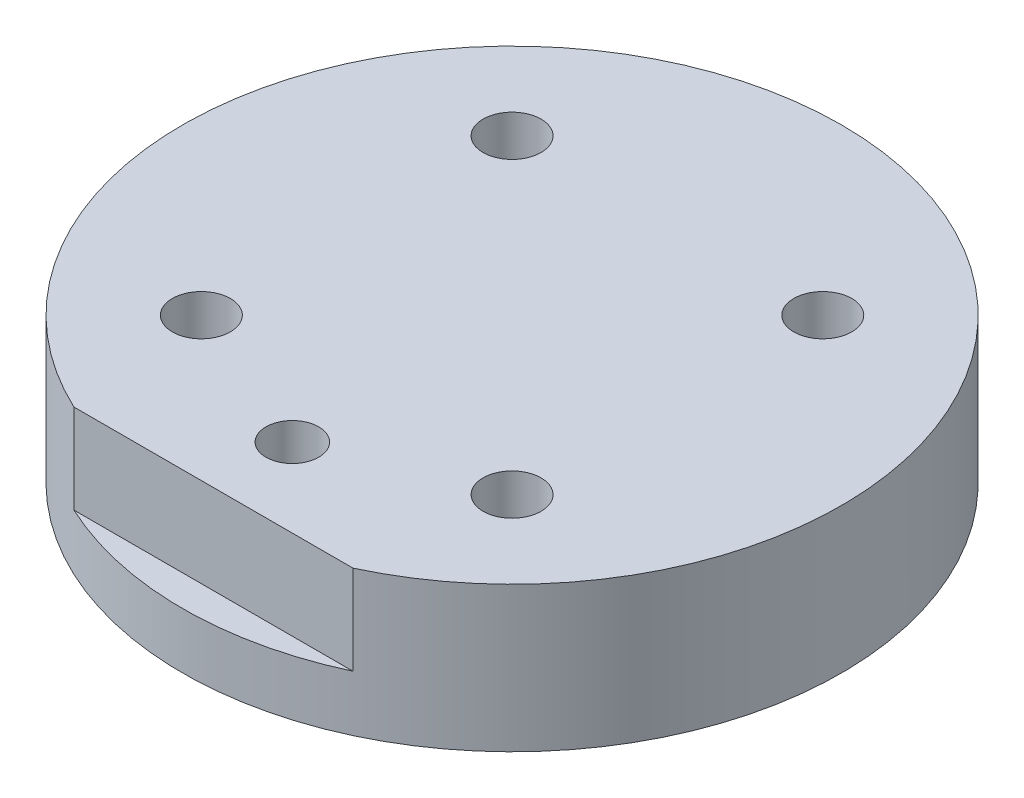
ISO-10303-21;
HEADER;
FILE_DESCRIPTION(('STEP AP214'),'2;1');
FILE_NAME('part.step','',(''),(''),'','','');
FILE_SCHEMA(('AUTOMOTIVE_DESIGN { 1 0 10303 214 1 1 1 1 }'));
ENDSEC;
DATA;
#1=APPLICATION_CONTEXT('core data for automotive mechanical design processes');
#2=APPLICATION_PROTOCOL_DEFINITION('international standard','automotive_design',2000,#1);
#3=PRODUCT_CONTEXT('',#1,'mechanical');
#4=PRODUCT('Part','Part','',(#3));
#5=PRODUCT_RELATED_PRODUCT_CATEGORY('part','',(#4));
#6=PRODUCT_DEFINITION_FORMATION('','',#4);
#7=PRODUCT_DEFINITION_CONTEXT('part definition',#1,'design');
#8=PRODUCT_DEFINITION('design','',#6,#7);
#9=PRODUCT_DEFINITION_SHAPE('','',#8);
#10=(LENGTH_UNIT() NAMED_UNIT(*) SI_UNIT(.MILLI.,.METRE.));
#11=(NAMED_UNIT(*) PLANE_ANGLE_UNIT() SI_UNIT($,.RADIAN.));
#12=(NAMED_UNIT(*) SI_UNIT($,.STERADIAN.) SOLID_ANGLE_UNIT());
#13=UNCERTAINTY_MEASURE_WITH_UNIT(LENGTH_MEASURE(1.E-05),#10,'distance_accuracy_value','');
#14=(GEOMETRIC_REPRESENTATION_CONTEXT(3) GLOBAL_UNCERTAINTY_ASSIGNED_CONTEXT((#13)) GLOBAL_UNIT_ASSIGNED_CONTEXT((#10,
#11,#12)) REPRESENTATION_CONTEXT('',''));
#15=CARTESIAN_POINT('',(0.,0.,0.));
#16=DIRECTION('',(0.,0.,1.));
#17=DIRECTION('',(1.,0.,0.));
#18=AXIS2_PLACEMENT_3D('',#15,#16,#17);
#19=CARTESIAN_POINT('',(0.,0.,0.));
#20=DIRECTION('',(0.,1.,0.));
#21=DIRECTION('',(0.,0.,1.));
#22=AXIS2_PLACEMENT_3D('',#19,#20,#21);
#23=PLANE('',#22);
#24=CARTESIAN_POINT('',(17.6776695296638,0.,17.6776695296637));
#25=DIRECTION('',(0.,-1.,0.));
#26=DIRECTION('',(0.,0.,-1.));
#27=AXIS2_PLACEMENT_3D('',#24,#25,#26);
#28=CIRCLE('',#27,6.3);
#29=CARTESIAN_POINT('',(17.6776695296638,0.,11.3776695296637));
#30=VERTEX_POINT('',#29);
#31=EDGE_CURVE('E215',#30,#30,#28,.T.);
#32=ORIENTED_EDGE('',*,*,#31,.F.);
#33=EDGE_LOOP('',(#32));
#34=FACE_BOUND('',#33,.T.);
#35=CARTESIAN_POINT('',(-17.6776695296637,0.,17.6776695296637));
#36=DIRECTION('',(0.,-1.,0.));
#37=DIRECTION('',(0.,0.,-1.));
#38=AXIS2_PLACEMENT_3D('',#35,#36,#37);
#39=CIRCLE('',#38,6.3);
#40=CARTESIAN_POINT('',(-17.6776695296637,0.,11.3776695296637));
#41=VERTEX_POINT('',#40);
#42=EDGE_CURVE('E206',#41,#41,#39,.T.);
#43=ORIENTED_EDGE('',*,*,#42,.F.);
#44=EDGE_LOOP('',(#43));
#45=FACE_BOUND('',#44,.T.);
#46=CARTESIAN_POINT('',(-17.6776695296638,0.,-17.6776695296637));
#47=DIRECTION('',(0.,-1.,0.));
#48=DIRECTION('',(0.,0.,-1.));
#49=AXIS2_PLACEMENT_3D('',#46,#47,#48);
#50=CIRCLE('',#49,6.3);
#51=CARTESIAN_POINT('',(-17.6776695296638,0.,-23.9776695296637));
#52=VERTEX_POINT('',#51);
#53=EDGE_CURVE('E197',#52,#52,#50,.T.);
#54=ORIENTED_EDGE('',*,*,#53,.F.);
#55=EDGE_LOOP('',(#54));
#56=FACE_BOUND('',#55,.T.);
#57=CARTESIAN_POINT('',(17.6776695296636,0.,-17.6776695296637));
#58=DIRECTION('',(0.,-1.,0.));
#59=DIRECTION('',(0.,0.,-1.));
#60=AXIS2_PLACEMENT_3D('',#57,#58,#59);
#61=CIRCLE('',#60,6.3);
#62=CARTESIAN_POINT('',(17.6776695296636,0.,-23.9776695296637));
#63=VERTEX_POINT('',#62);
#64=EDGE_CURVE('E188',#63,#63,#61,.T.);
#65=ORIENTED_EDGE('',*,*,#64,.F.);
#66=EDGE_LOOP('',(#65));
#67=FACE_BOUND('',#66,.T.);
#68=CARTESIAN_POINT('',(-27.305,0.,-16.1925));
#69=DIRECTION('',(0.,-1.,0.));
#70=DIRECTION('',(0.,0.,-1.));
#71=AXIS2_PLACEMENT_3D('',#68,#69,#70);
#72=CIRCLE('',#71,2.09999999999999);
#73=CARTESIAN_POINT('',(-27.305,0.,-18.2925));
#74=VERTEX_POINT('',#73);
#75=EDGE_CURVE('E182',#74,#74,#72,.T.);
#76=ORIENTED_EDGE('',*,*,#75,.F.);
#77=EDGE_LOOP('',(#76));
#78=FACE_BOUND('',#77,.T.);
#79=CARTESIAN_POINT('',(-27.305,0.,16.1925));
#80=DIRECTION('',(0.,-1.,0.));
#81=DIRECTION('',(0.,0.,-1.));
#82=AXIS2_PLACEMENT_3D('',#79,#80,#81);
#83=CIRCLE('',#82,2.09999999999999);
#84=CARTESIAN_POINT('',(-27.305,0.,14.0925));
#85=VERTEX_POINT('',#84);
#86=EDGE_CURVE('E176',#85,#85,#83,.T.);
#87=ORIENTED_EDGE('',*,*,#86,.F.);
#88=EDGE_LOOP('',(#87));
#89=FACE_BOUND('',#88,.T.);
#90=CARTESIAN_POINT('',(27.305,0.,16.1925));
#91=DIRECTION('',(0.,-1.,0.));
#92=DIRECTION('',(0.,0.,-1.));
#93=AXIS2_PLACEMENT_3D('',#90,#91,#92);
#94=CIRCLE('',#93,2.09999999999999);
#95=CARTESIAN_POINT('',(27.305,0.,14.0925));
#96=VERTEX_POINT('',#95);
#97=EDGE_CURVE('E170',#96,#96,#94,.T.);
#98=ORIENTED_EDGE('',*,*,#97,.F.);
#99=EDGE_LOOP('',(#98));
#100=FACE_BOUND('',#99,.T.);
#101=CARTESIAN_POINT('',(27.305,0.,-16.1925));
#102=DIRECTION('',(0.,-1.,0.));
#103=DIRECTION('',(0.,0.,-1.));
#104=AXIS2_PLACEMENT_3D('',#101,#102,#103);
#105=CIRCLE('',#104,2.09999999999999);
#106=CARTESIAN_POINT('',(27.305,0.,-18.2925));
#107=VERTEX_POINT('',#106);
#108=EDGE_CURVE('E162',#107,#107,#105,.T.);
#109=ORIENTED_EDGE('',*,*,#108,.F.);
#110=EDGE_LOOP('',(#109));
#111=FACE_BOUND('',#110,.T.);
#112=CARTESIAN_POINT('',(-30.5150000000001,0.,0.));
#113=DIRECTION('',(0.,1.,0.));
#114=DIRECTION('',(0.,0.,1.));
#115=AXIS2_PLACEMENT_3D('',#112,#113,#114);
#116=CIRCLE('',#115,1.9685);
#117=CARTESIAN_POINT('',(-30.5150000000001,0.,1.9685));
#118=VERTEX_POINT('',#117);
#119=EDGE_CURVE('E153',#118,#118,#116,.T.);
#120=ORIENTED_EDGE('',*,*,#119,.T.);
#121=EDGE_LOOP('',(#120));
#122=FACE_BOUND('',#121,.T.);
#123=DIRECTION('',(1.,0.,0.));
#124=VECTOR('',#123,1.);
#125=CARTESIAN_POINT('',(-18.9072000000001,0.,-3.175));
#126=LINE('',#125,#124);
#127=CARTESIAN_POINT('',(-18.9072000000001,0.,-3.175));
#128=VERTEX_POINT('',#127);
#129=CARTESIAN_POINT('',(-6.2072000000001,0.,-3.175));
#130=VERTEX_POINT('',#129);
#131=EDGE_CURVE('E134',#128,#130,#126,.T.);
#132=ORIENTED_EDGE('',*,*,#131,.F.);
#133=DIRECTION('',(0.,0.,1.));
#134=VECTOR('',#133,1.);
#135=CARTESIAN_POINT('',(-18.9072000000001,0.,-3.175));
#136=LINE('',#135,#134);
#137=CARTESIAN_POINT('',(-18.9072000000001,0.,3.175));
#138=VERTEX_POINT('',#137);
#139=EDGE_CURVE('E142',#128,#138,#136,.T.);
#140=ORIENTED_EDGE('',*,*,#139,.T.);
#141=DIRECTION('',(1.,0.,0.));
#142=VECTOR('',#141,1.);
#143=CARTESIAN_POINT('',(-18.9072000000001,0.,3.175));
#144=LINE('',#143,#142);
#145=CARTESIAN_POINT('',(-6.2072000000001,0.,3.175));
#146=VERTEX_POINT('',#145);
#147=EDGE_CURVE('E145',#138,#146,#144,.T.);
#148=ORIENTED_EDGE('',*,*,#147,.T.);
#149=DIRECTION('',(0.,0.,1.));
#150=VECTOR('',#149,1.);
#151=CARTESIAN_POINT('',(-6.2072000000001,0.,-3.175));
#152=LINE('',#151,#150);
#153=EDGE_CURVE('E65',#130,#146,#152,.T.);
#154=ORIENTED_EDGE('',*,*,#153,.F.);
#155=EDGE_LOOP('',(#132,#140,#148,#154));
#156=FACE_BOUND('',#155,.T.);
#157=CARTESIAN_POINT('',(0.,0.,0.));
#158=DIRECTION('',(0.,-1.,0.));
#159=DIRECTION('',(0.,0.,-1.));
#160=AXIS2_PLACEMENT_3D('',#157,#158,#159);
#161=CIRCLE('',#160,34.9600000000001);
#162=CARTESIAN_POINT('',(0.,0.,-34.9600000000001));
#163=VERTEX_POINT('',#162);
#164=EDGE_CURVE('E368',#163,#163,#161,.T.);
#165=ORIENTED_EDGE('',*,*,#164,.T.);
#166=EDGE_LOOP('',(#165));
#167=FACE_BOUND('',#166,.T.);
#168=ADVANCED_FACE('F41',(#34,#45,#56,#67,#78,#89,#100,#111,#122,#156,#167),#23,.F.);
#169=CARTESIAN_POINT('',(0.,13.97,0.));
#170=DIRECTION('',(0.,1.,0.));
#171=DIRECTION('',(0.,0.,1.));
#172=AXIS2_PLACEMENT_3D('',#169,#170,#171);
#173=PLANE('',#172);
#174=CARTESIAN_POINT('',(17.6776695296638,13.97,17.6776695296637));
#175=DIRECTION('',(0.,-1.,0.));
#176=DIRECTION('',(0.,0.,-1.));
#177=AXIS2_PLACEMENT_3D('',#174,#175,#176);
#178=CIRCLE('',#177,3.3);
#179=CARTESIAN_POINT('',(17.6776695296638,13.97,14.3776695296637));
#180=VERTEX_POINT('',#179);
#181=EDGE_CURVE('E221',#180,#180,#178,.T.);
#182=ORIENTED_EDGE('',*,*,#181,.T.);
#183=EDGE_LOOP('',(#182));
#184=FACE_BOUND('',#183,.T.);
#185=CARTESIAN_POINT('',(-17.6776695296637,13.97,17.6776695296637));
#186=DIRECTION('',(0.,-1.,0.));
#187=DIRECTION('',(0.,0.,-1.));
#188=AXIS2_PLACEMENT_3D('',#185,#186,#187);
#189=CIRCLE('',#188,3.3);
#190=CARTESIAN_POINT('',(-17.6776695296637,13.97,14.3776695296637));
#191=VERTEX_POINT('',#190);
#192=EDGE_CURVE('E212',#191,#191,#189,.T.);
#193=ORIENTED_EDGE('',*,*,#192,.T.);
#194=EDGE_LOOP('',(#193));
#195=FACE_BOUND('',#194,.T.);
#196=CARTESIAN_POINT('',(-17.6776695296638,13.97,-17.6776695296637));
#197=DIRECTION('',(0.,-1.,0.));
#198=DIRECTION('',(0.,0.,-1.));
#199=AXIS2_PLACEMENT_3D('',#196,#197,#198);
#200=CIRCLE('',#199,3.3);
#201=CARTESIAN_POINT('',(-17.6776695296638,13.97,-20.9776695296637));
#202=VERTEX_POINT('',#201);
#203=EDGE_CURVE('E203',#202,#202,#200,.T.);
#204=ORIENTED_EDGE('',*,*,#203,.T.);
#205=EDGE_LOOP('',(#204));
#206=FACE_BOUND('',#205,.T.);
#207=CARTESIAN_POINT('',(17.6776695296636,13.97,-17.6776695296637));
#208=DIRECTION('',(0.,-1.,0.));
#209=DIRECTION('',(0.,0.,-1.));
#210=AXIS2_PLACEMENT_3D('',#207,#208,#209);
#211=CIRCLE('',#210,3.3);
#212=CARTESIAN_POINT('',(17.6776695296636,13.97,-20.9776695296637));
#213=VERTEX_POINT('',#212);
#214=EDGE_CURVE('E194',#213,#213,#211,.T.);
#215=ORIENTED_EDGE('',*,*,#214,.T.);
#216=EDGE_LOOP('',(#215));
#217=FACE_BOUND('',#216,.T.);
#218=DIRECTION('',(-1.,0.,0.));
#219=VECTOR('',#218,1.);
#220=CARTESIAN_POINT('',(0.,13.97,33.974025004406));
#221=LINE('',#220,#219);
#222=CARTESIAN_POINT('',(15.875,13.97,33.974025004406));
#223=VERTEX_POINT('',#222);
#224=CARTESIAN_POINT('',(-15.875,13.97,33.974025004406));
#225=VERTEX_POINT('',#224);
#226=EDGE_CURVE('E115',#223,#225,#221,.T.);
#227=ORIENTED_EDGE('',*,*,#226,.F.);
#228=CARTESIAN_POINT('',(0.,13.97,0.));
#229=DIRECTION('',(0.,1.,0.));
#230=DIRECTION('',(0.,0.,1.));
#231=AXIS2_PLACEMENT_3D('',#228,#229,#230);
#232=CIRCLE('',#231,37.5000000000001);
#233=EDGE_CURVE('E124',#223,#225,#232,.T.);
#234=ORIENTED_EDGE('',*,*,#233,.T.);
#235=EDGE_LOOP('',(#227,#234));
#236=FACE_BOUND('',#235,.T.);
#237=CARTESIAN_POINT('',(0.,13.97,24.9999999999999));
#238=DIRECTION('',(0.,1.,0.));
#239=DIRECTION('',(0.,0.,1.));
#240=AXIS2_PLACEMENT_3D('',#237,#238,#239);
#241=CIRCLE('',#240,3.00000000000866);
#242=CARTESIAN_POINT('',(0.,13.97,28.0000000000086));
#243=VERTEX_POINT('',#242);
#244=EDGE_CURVE('E126',#243,#243,#241,.F.);
#245=ORIENTED_EDGE('',*,*,#244,.T.);
#246=EDGE_LOOP('',(#245));
#247=FACE_BOUND('',#246,.T.);
#248=ADVANCED_FACE('F239',(#184,#195,#206,#217,#236,#247),#173,.T.);
#249=CARTESIAN_POINT('',(0.,13.97,0.));
#250=DIRECTION('',(0.,-1.,0.));
#251=DIRECTION('',(0.,0.,-1.));
#252=AXIS2_PLACEMENT_3D('',#249,#250,#251);
#253=CYLINDRICAL_SURFACE('',#252,37.5000000000001);
#254=ORIENTED_EDGE('',*,*,#233,.F.);
#255=DIRECTION('',(0.,1.,0.));
#256=VECTOR('',#255,1.);
#257=CARTESIAN_POINT('',(15.875,3.81,33.974025004406));
#258=LINE('',#257,#256);
#259=CARTESIAN_POINT('',(15.875,3.81,33.974025004406));
#260=VERTEX_POINT('',#259);
#261=EDGE_CURVE('E57',#260,#223,#258,.T.);
#262=ORIENTED_EDGE('',*,*,#261,.F.);
#263=CARTESIAN_POINT('',(0.,3.81,0.));
#264=DIRECTION('',(0.,1.,0.));
#265=DIRECTION('',(0.,0.,1.));
#266=AXIS2_PLACEMENT_3D('',#263,#264,#265);
#267=CIRCLE('',#266,37.5000000000001);
#268=CARTESIAN_POINT('',(-15.875,3.81,33.974025004406));
#269=VERTEX_POINT('',#268);
#270=EDGE_CURVE('E110',#269,#260,#267,.T.);
#271=ORIENTED_EDGE('',*,*,#270,.F.);
#272=DIRECTION('',(0.,1.,0.));
#273=VECTOR('',#272,1.);
#274=CARTESIAN_POINT('',(-15.875,3.81,33.974025004406));
#275=LINE('',#274,#273);
#276=EDGE_CURVE('E118',#269,#225,#275,.T.);
#277=ORIENTED_EDGE('',*,*,#276,.T.);
#278=EDGE_LOOP('',(#254,#262,#271,#277));
#279=FACE_BOUND('',#278,.T.);
#280=CARTESIAN_POINT('',(0.,-2.54,0.));
#281=DIRECTION('',(0.,-1.,0.));
#282=DIRECTION('',(0.,0.,-1.));
#283=AXIS2_PLACEMENT_3D('',#280,#281,#282);
#284=CIRCLE('',#283,37.5000000000001);
#285=CARTESIAN_POINT('',(0.,-2.54,-37.5000000000001));
#286=VERTEX_POINT('',#285);
#287=EDGE_CURVE('E367',#286,#286,#284,.T.);
#288=ORIENTED_EDGE('',*,*,#287,.F.);
#289=EDGE_LOOP('',(#288));
#290=FACE_BOUND('',#289,.T.);
#291=ADVANCED_FACE('F121',(#279,#290),#253,.T.);
#292=CARTESIAN_POINT('',(17.6776695296638,0.,17.6776695296637));
#293=DIRECTION('',(0.,-1.,0.));
#294=DIRECTION('',(0.,0.,-1.));
#295=AXIS2_PLACEMENT_3D('',#292,#293,#294);
#296=CYLINDRICAL_SURFACE('',#295,3.3);
#297=ORIENTED_EDGE('',*,*,#181,.F.);
#298=EDGE_LOOP('',(#297));
#299=FACE_BOUND('',#298,.T.);
#300=CARTESIAN_POINT('',(17.6776695296638,3.,17.6776695296637));
#301=DIRECTION('',(0.,-1.,0.));
#302=DIRECTION('',(0.,0.,-1.));
#303=AXIS2_PLACEMENT_3D('',#300,#301,#302);
#304=CIRCLE('',#303,3.3);
#305=CARTESIAN_POINT('',(17.6776695296638,3.,14.3776695296637));
#306=VERTEX_POINT('',#305);
#307=EDGE_CURVE('E218',#306,#306,#304,.T.);
#308=ORIENTED_EDGE('',*,*,#307,.T.);
#309=EDGE_LOOP('',(#308));
#310=FACE_BOUND('',#309,.T.);
#311=ADVANCED_FACE('F251',(#299,#310),#296,.F.);
#312=CARTESIAN_POINT('',(17.6776695296638,0.,17.6776695296637));
#313=DIRECTION('',(0.,-1.,0.));
#314=DIRECTION('',(0.,0.,-1.));
#315=AXIS2_PLACEMENT_3D('',#312,#313,#314);
#316=CONICAL_SURFACE('',#315,6.3,0.785398163397448);
#317=ORIENTED_EDGE('',*,*,#307,.F.);
#318=EDGE_LOOP('',(#317));
#319=FACE_BOUND('',#318,.T.);
#320=ORIENTED_EDGE('',*,*,#31,.T.);
#321=EDGE_LOOP('',(#320));
#322=FACE_BOUND('',#321,.T.);
#323=ADVANCED_FACE('F255',(#319,#322),#316,.F.);
#324=CARTESIAN_POINT('',(-17.6776695296637,0.,17.6776695296637));
#325=DIRECTION('',(0.,-1.,0.));
#326=DIRECTION('',(0.,0.,-1.));
#327=AXIS2_PLACEMENT_3D('',#324,#325,#326);
#328=CYLINDRICAL_SURFACE('',#327,3.3);
#329=ORIENTED_EDGE('',*,*,#192,.F.);
#330=EDGE_LOOP('',(#329));
#331=FACE_BOUND('',#330,.T.);
#332=CARTESIAN_POINT('',(-17.6776695296637,3.,17.6776695296637));
#333=DIRECTION('',(0.,-1.,0.));
#334=DIRECTION('',(0.,0.,-1.));
#335=AXIS2_PLACEMENT_3D('',#332,#333,#334);
#336=CIRCLE('',#335,3.3);
#337=CARTESIAN_POINT('',(-17.6776695296637,3.,14.3776695296637));
#338=VERTEX_POINT('',#337);
#339=EDGE_CURVE('E209',#338,#338,#336,.T.);
#340=ORIENTED_EDGE('',*,*,#339,.T.);
#341=EDGE_LOOP('',(#340));
#342=FACE_BOUND('',#341,.T.);
#343=ADVANCED_FACE('F260',(#331,#342),#328,.F.);
#344=CARTESIAN_POINT('',(-17.6776695296637,0.,17.6776695296637));
#345=DIRECTION('',(0.,-1.,0.));
#346=DIRECTION('',(0.,0.,-1.));
#347=AXIS2_PLACEMENT_3D('',#344,#345,#346);
#348=CONICAL_SURFACE('',#347,6.3,0.785398163397448);
#349=ORIENTED_EDGE('',*,*,#339,.F.);
#350=EDGE_LOOP('',(#349));
#351=FACE_BOUND('',#350,.T.);
#352=ORIENTED_EDGE('',*,*,#42,.T.);
#353=EDGE_LOOP('',(#352));
#354=FACE_BOUND('',#353,.T.);
#355=ADVANCED_FACE('F268',(#351,#354),#348,.F.);
#356=CARTESIAN_POINT('',(-17.6776695296638,0.,-17.6776695296637));
#357=DIRECTION('',(0.,-1.,0.));
#358=DIRECTION('',(0.,0.,-1.));
#359=AXIS2_PLACEMENT_3D('',#356,#357,#358);
#360=CYLINDRICAL_SURFACE('',#359,3.3);
#361=ORIENTED_EDGE('',*,*,#203,.F.);
#362=EDGE_LOOP('',(#361));
#363=FACE_BOUND('',#362,.T.);
#364=CARTESIAN_POINT('',(-17.6776695296638,3.,-17.6776695296637));
#365=DIRECTION('',(0.,-1.,0.));
#366=DIRECTION('',(0.,0.,-1.));
#367=AXIS2_PLACEMENT_3D('',#364,#365,#366);
#368=CIRCLE('',#367,3.3);
#369=CARTESIAN_POINT('',(-17.6776695296638,3.,-20.9776695296637));
#370=VERTEX_POINT('',#369);
#371=EDGE_CURVE('E200',#370,#370,#368,.T.);
#372=ORIENTED_EDGE('',*,*,#371,.T.);
#373=EDGE_LOOP('',(#372));
#374=FACE_BOUND('',#373,.T.);
#375=ADVANCED_FACE('F272',(#363,#374),#360,.F.);
#376=CARTESIAN_POINT('',(-17.6776695296638,0.,-17.6776695296637));
#377=DIRECTION('',(0.,-1.,0.));
#378=DIRECTION('',(0.,0.,-1.));
#379=AXIS2_PLACEMENT_3D('',#376,#377,#378);
#380=CONICAL_SURFACE('',#379,6.3,0.785398163397448);
#381=ORIENTED_EDGE('',*,*,#371,.F.);
#382=EDGE_LOOP('',(#381));
#383=FACE_BOUND('',#382,.T.);
#384=ORIENTED_EDGE('',*,*,#53,.T.);
#385=EDGE_LOOP('',(#384));
#386=FACE_BOUND('',#385,.T.);
#387=ADVANCED_FACE('F276',(#383,#386),#380,.F.);
#388=CARTESIAN_POINT('',(17.6776695296636,0.,-17.6776695296637));
#389=DIRECTION('',(0.,-1.,0.));
#390=DIRECTION('',(0.,0.,-1.));
#391=AXIS2_PLACEMENT_3D('',#388,#389,#390);
#392=CYLINDRICAL_SURFACE('',#391,3.3);
#393=ORIENTED_EDGE('',*,*,#214,.F.);
#394=EDGE_LOOP('',(#393));
#395=FACE_BOUND('',#394,.T.);
#396=CARTESIAN_POINT('',(17.6776695296636,3.,-17.6776695296637));
#397=DIRECTION('',(0.,-1.,0.));
#398=DIRECTION('',(0.,0.,-1.));
#399=AXIS2_PLACEMENT_3D('',#396,#397,#398);
#400=CIRCLE('',#399,3.3);
#401=CARTESIAN_POINT('',(17.6776695296636,3.,-20.9776695296637));
#402=VERTEX_POINT('',#401);
#403=EDGE_CURVE('E191',#402,#402,#400,.T.);
#404=ORIENTED_EDGE('',*,*,#403,.T.);
#405=EDGE_LOOP('',(#404));
#406=FACE_BOUND('',#405,.T.);
#407=ADVANCED_FACE('F280',(#395,#406),#392,.F.);
#408=CARTESIAN_POINT('',(17.6776695296636,0.,-17.6776695296637));
#409=DIRECTION('',(0.,-1.,0.));
#410=DIRECTION('',(0.,0.,-1.));
#411=AXIS2_PLACEMENT_3D('',#408,#409,#410);
#412=CONICAL_SURFACE('',#411,6.3,0.785398163397448);
#413=ORIENTED_EDGE('',*,*,#403,.F.);
#414=EDGE_LOOP('',(#413));
#415=FACE_BOUND('',#414,.T.);
#416=ORIENTED_EDGE('',*,*,#64,.T.);
#417=EDGE_LOOP('',(#416));
#418=FACE_BOUND('',#417,.T.);
#419=ADVANCED_FACE('F284',(#415,#418),#412,.F.);
#420=CARTESIAN_POINT('',(-27.305,12.192,-16.1925));
#421=DIRECTION('',(0.,-1.,0.));
#422=DIRECTION('',(0.,0.,-1.));
#423=AXIS2_PLACEMENT_3D('',#420,#421,#422);
#424=CONICAL_SURFACE('',#423,2.09999999999999,1.02974425867665);
#425=CARTESIAN_POINT('',(-27.305,13.4538072999579,-16.1925));
#426=VERTEX_POINT('',#425);
#427=VERTEX_LOOP('',#426);
#428=FACE_BOUND('',#427,.T.);
#429=CARTESIAN_POINT('',(-27.305,12.192,-16.1925));
#430=DIRECTION('',(0.,-1.,0.));
#431=DIRECTION('',(0.,0.,-1.));
#432=AXIS2_PLACEMENT_3D('',#429,#430,#431);
#433=CIRCLE('',#432,2.09999999999999);
#434=CARTESIAN_POINT('',(-27.305,12.192,-18.2925));
#435=VERTEX_POINT('',#434);
#436=EDGE_CURVE('E185',#435,#435,#433,.T.);
#437=ORIENTED_EDGE('',*,*,#436,.T.);
#438=EDGE_LOOP('',(#437));
#439=FACE_BOUND('',#438,.T.);
#440=ADVANCED_FACE('F288',(#428,#439),#424,.F.);
#441=CARTESIAN_POINT('',(-27.305,0.,-16.1925));
#442=DIRECTION('',(0.,-1.,0.));
#443=DIRECTION('',(0.,0.,-1.));
#444=AXIS2_PLACEMENT_3D('',#441,#442,#443);
#445=CYLINDRICAL_SURFACE('',#444,2.09999999999999);
#446=ORIENTED_EDGE('',*,*,#436,.F.);
#447=EDGE_LOOP('',(#446));
#448=FACE_BOUND('',#447,.T.);
#449=ORIENTED_EDGE('',*,*,#75,.T.);
#450=EDGE_LOOP('',(#449));
#451=FACE_BOUND('',#450,.T.);
#452=ADVANCED_FACE('F292',(#448,#451),#445,.F.);
#453=CARTESIAN_POINT('',(-27.305,12.192,16.1925));
#454=DIRECTION('',(0.,-1.,0.));
#455=DIRECTION('',(0.,0.,-1.));
#456=AXIS2_PLACEMENT_3D('',#453,#454,#455);
#457=CONICAL_SURFACE('',#456,2.09999999999999,1.02974425867665);
#458=CARTESIAN_POINT('',(-27.305,13.4538072999579,16.1925));
#459=VERTEX_POINT('',#458);
#460=VERTEX_LOOP('',#459);
#461=FACE_BOUND('',#460,.T.);
#462=CARTESIAN_POINT('',(-27.305,12.192,16.1925));
#463=DIRECTION('',(0.,-1.,0.));
#464=DIRECTION('',(0.,0.,-1.));
#465=AXIS2_PLACEMENT_3D('',#462,#463,#464);
#466=CIRCLE('',#465,2.09999999999999);
#467=CARTESIAN_POINT('',(-27.305,12.192,14.0925));
#468=VERTEX_POINT('',#467);
#469=EDGE_CURVE('E179',#468,#468,#466,.T.);
#470=ORIENTED_EDGE('',*,*,#469,.T.);
#471=EDGE_LOOP('',(#470));
#472=FACE_BOUND('',#471,.T.);
#473=ADVANCED_FACE('F296',(#461,#472),#457,.F.);
#474=CARTESIAN_POINT('',(-27.305,0.,16.1925));
#475=DIRECTION('',(0.,-1.,0.));
#476=DIRECTION('',(0.,0.,-1.));
#477=AXIS2_PLACEMENT_3D('',#474,#475,#476);
#478=CYLINDRICAL_SURFACE('',#477,2.09999999999999);
#479=ORIENTED_EDGE('',*,*,#469,.F.);
#480=EDGE_LOOP('',(#479));
#481=FACE_BOUND('',#480,.T.);
#482=ORIENTED_EDGE('',*,*,#86,.T.);
#483=EDGE_LOOP('',(#482));
#484=FACE_BOUND('',#483,.T.);
#485=ADVANCED_FACE('F300',(#481,#484),#478,.F.);
#486=CARTESIAN_POINT('',(27.305,12.192,16.1925));
#487=DIRECTION('',(0.,-1.,0.));
#488=DIRECTION('',(0.,0.,-1.));
#489=AXIS2_PLACEMENT_3D('',#486,#487,#488);
#490=CONICAL_SURFACE('',#489,2.09999999999999,1.02974425867665);
#491=CARTESIAN_POINT('',(27.305,13.4538072999579,16.1925));
#492=VERTEX_POINT('',#491);
#493=VERTEX_LOOP('',#492);
#494=FACE_BOUND('',#493,.T.);
#495=CARTESIAN_POINT('',(27.305,12.192,16.1925));
#496=DIRECTION('',(0.,-1.,0.));
#497=DIRECTION('',(0.,0.,-1.));
#498=AXIS2_PLACEMENT_3D('',#495,#496,#497);
#499=CIRCLE('',#498,2.09999999999999);
#500=CARTESIAN_POINT('',(27.305,12.192,14.0925));
#501=VERTEX_POINT('',#500);
#502=EDGE_CURVE('E173',#501,#501,#499,.T.);
#503=ORIENTED_EDGE('',*,*,#502,.T.);
#504=EDGE_LOOP('',(#503));
#505=FACE_BOUND('',#504,.T.);
#506=ADVANCED_FACE('F304',(#494,#505),#490,.F.);
#507=CARTESIAN_POINT('',(27.305,0.,16.1925));
#508=DIRECTION('',(0.,-1.,0.));
#509=DIRECTION('',(0.,0.,-1.));
#510=AXIS2_PLACEMENT_3D('',#507,#508,#509);
#511=CYLINDRICAL_SURFACE('',#510,2.09999999999999);
#512=ORIENTED_EDGE('',*,*,#502,.F.);
#513=EDGE_LOOP('',(#512));
#514=FACE_BOUND('',#513,.T.);
#515=ORIENTED_EDGE('',*,*,#97,.T.);
#516=EDGE_LOOP('',(#515));
#517=FACE_BOUND('',#516,.T.);
#518=ADVANCED_FACE('F308',(#514,#517),#511,.F.);
#519=CARTESIAN_POINT('',(27.305,12.192,-16.1925));
#520=DIRECTION('',(0.,-1.,0.));
#521=DIRECTION('',(0.,0.,-1.));
#522=AXIS2_PLACEMENT_3D('',#519,#520,#521);
#523=CONICAL_SURFACE('',#522,2.09999999999999,1.02974425867665);
#524=CARTESIAN_POINT('',(27.305,13.4538072999579,-16.1925));
#525=VERTEX_POINT('',#524);
#526=VERTEX_LOOP('',#525);
#527=FACE_BOUND('',#526,.T.);
#528=CARTESIAN_POINT('',(27.305,12.192,-16.1925));
#529=DIRECTION('',(0.,-1.,0.));
#530=DIRECTION('',(0.,0.,-1.));
#531=AXIS2_PLACEMENT_3D('',#528,#529,#530);
#532=CIRCLE('',#531,2.09999999999999);
#533=CARTESIAN_POINT('',(27.305,12.192,-18.2925));
#534=VERTEX_POINT('',#533);
#535=EDGE_CURVE('E167',#534,#534,#532,.T.);
#536=ORIENTED_EDGE('',*,*,#535,.T.);
#537=EDGE_LOOP('',(#536));
#538=FACE_BOUND('',#537,.T.);
#539=ADVANCED_FACE('F312',(#527,#538),#523,.F.);
#540=CARTESIAN_POINT('',(27.305,0.,-16.1925));
#541=DIRECTION('',(0.,-1.,0.));
#542=DIRECTION('',(0.,0.,-1.));
#543=AXIS2_PLACEMENT_3D('',#540,#541,#542);
#544=CYLINDRICAL_SURFACE('',#543,2.09999999999999);
#545=ORIENTED_EDGE('',*,*,#535,.F.);
#546=EDGE_LOOP('',(#545));
#547=FACE_BOUND('',#546,.T.);
#548=ORIENTED_EDGE('',*,*,#108,.T.);
#549=EDGE_LOOP('',(#548));
#550=FACE_BOUND('',#549,.T.);
#551=ADVANCED_FACE('F316',(#547,#550),#544,.F.);
#552=CARTESIAN_POINT('',(-30.5150000000001,5.08,0.));
#553=DIRECTION('',(0.,-1.,0.));
#554=DIRECTION('',(0.,0.,-1.));
#555=AXIS2_PLACEMENT_3D('',#552,#553,#554);
#556=CYLINDRICAL_SURFACE('',#555,1.9685);
#557=CARTESIAN_POINT('',(-30.5150000000001,5.08,0.));
#558=DIRECTION('',(0.,1.,0.));
#559=DIRECTION('',(0.,0.,1.));
#560=AXIS2_PLACEMENT_3D('',#557,#558,#559);
#561=CIRCLE('',#560,1.9685);
#562=CARTESIAN_POINT('',(-30.5150000000001,5.08,1.9685));
#563=VERTEX_POINT('',#562);
#564=EDGE_CURVE('E159',#563,#563,#561,.T.);
#565=ORIENTED_EDGE('',*,*,#564,.T.);
#566=EDGE_LOOP('',(#565));
#567=FACE_BOUND('',#566,.T.);
#568=ORIENTED_EDGE('',*,*,#119,.F.);
#569=EDGE_LOOP('',(#568));
#570=FACE_BOUND('',#569,.T.);
#571=ADVANCED_FACE('F320',(#567,#570),#556,.F.);
#572=CARTESIAN_POINT('',(-30.5150000000001,5.08,0.));
#573=DIRECTION('',(0.,1.,0.));
#574=DIRECTION('',(0.,0.,1.));
#575=AXIS2_PLACEMENT_3D('',#572,#573,#574);
#576=PLANE('',#575);
#577=ORIENTED_EDGE('',*,*,#564,.F.);
#578=EDGE_LOOP('',(#577));
#579=FACE_BOUND('',#578,.T.);
#580=ADVANCED_FACE('F324',(#579),#576,.F.);
#581=CARTESIAN_POINT('',(-18.9072000000001,-3.048,-3.175));
#582=DIRECTION('',(-1.,0.,0.));
#583=DIRECTION('',(0.,0.,1.));
#584=AXIS2_PLACEMENT_3D('',#581,#582,#583);
#585=PLANE('',#584);
#586=ORIENTED_EDGE('',*,*,#139,.F.);
#587=DIRECTION('',(0.,1.,0.));
#588=VECTOR('',#587,1.);
#589=CARTESIAN_POINT('',(-18.9072000000001,-3.048,-3.175));
#590=LINE('',#589,#588);
#591=CARTESIAN_POINT('',(-18.9072000000001,-3.048,-3.175));
#592=VERTEX_POINT('',#591);
#593=EDGE_CURVE('E151',#592,#128,#590,.T.);
#594=ORIENTED_EDGE('',*,*,#593,.F.);
#595=DIRECTION('',(0.,0.,1.));
#596=VECTOR('',#595,1.);
#597=CARTESIAN_POINT('',(-18.9072000000001,-3.048,-3.175));
#598=LINE('',#597,#596);
#599=CARTESIAN_POINT('',(-18.9072000000001,-3.048,3.175));
#600=VERTEX_POINT('',#599);
#601=EDGE_CURVE('E130',#592,#600,#598,.T.);
#602=ORIENTED_EDGE('',*,*,#601,.T.);
#603=DIRECTION('',(0.,1.,0.));
#604=VECTOR('',#603,1.);
#605=CARTESIAN_POINT('',(-18.9072000000001,-3.048,3.175));
#606=LINE('',#605,#604);
#607=EDGE_CURVE('E141',#600,#138,#606,.T.);
#608=ORIENTED_EDGE('',*,*,#607,.T.);
#609=EDGE_LOOP('',(#586,#594,#602,#608));
#610=FACE_BOUND('',#609,.T.);
#611=ADVANCED_FACE('F328',(#610),#585,.T.);
#612=CARTESIAN_POINT('',(-18.9072000000001,-3.048,-3.175));
#613=DIRECTION('',(0.,0.,1.));
#614=DIRECTION('',(1.,0.,0.));
#615=AXIS2_PLACEMENT_3D('',#612,#613,#614);
#616=PLANE('',#615);
#617=ORIENTED_EDGE('',*,*,#131,.T.);
#618=DIRECTION('',(0.,1.,0.));
#619=VECTOR('',#618,1.);
#620=CARTESIAN_POINT('',(-6.2072000000001,-3.048,-3.175));
#621=LINE('',#620,#619);
#622=CARTESIAN_POINT('',(-6.2072000000001,-3.048,-3.175));
#623=VERTEX_POINT('',#622);
#624=EDGE_CURVE('E154',#623,#130,#621,.T.);
#625=ORIENTED_EDGE('',*,*,#624,.F.);
#626=DIRECTION('',(1.,0.,0.));
#627=VECTOR('',#626,1.);
#628=CARTESIAN_POINT('',(-18.9072000000001,-3.048,-3.175));
#629=LINE('',#628,#627);
#630=EDGE_CURVE('E139',#592,#623,#629,.T.);
#631=ORIENTED_EDGE('',*,*,#630,.F.);
#632=ORIENTED_EDGE('',*,*,#593,.T.);
#633=EDGE_LOOP('',(#617,#625,#631,#632));
#634=FACE_BOUND('',#633,.T.);
#635=ADVANCED_FACE('F332',(#634),#616,.F.);
#636=CARTESIAN_POINT('',(-6.2072000000001,-3.048,-3.175));
#637=DIRECTION('',(-1.,0.,0.));
#638=DIRECTION('',(0.,0.,1.));
#639=AXIS2_PLACEMENT_3D('',#636,#637,#638);
#640=PLANE('',#639);
#641=ORIENTED_EDGE('',*,*,#153,.T.);
#642=DIRECTION('',(0.,1.,0.));
#643=VECTOR('',#642,1.);
#644=CARTESIAN_POINT('',(-6.2072000000001,-3.048,3.175));
#645=LINE('',#644,#643);
#646=CARTESIAN_POINT('',(-6.2072000000001,-3.048,3.175));
#647=VERTEX_POINT('',#646);
#648=EDGE_CURVE('E156',#647,#146,#645,.T.);
#649=ORIENTED_EDGE('',*,*,#648,.F.);
#650=DIRECTION('',(0.,0.,1.));
#651=VECTOR('',#650,1.);
#652=CARTESIAN_POINT('',(-6.2072000000001,-3.048,-3.175));
#653=LINE('',#652,#651);
#654=EDGE_CURVE('E137',#623,#647,#653,.T.);
#655=ORIENTED_EDGE('',*,*,#654,.F.);
#656=ORIENTED_EDGE('',*,*,#624,.T.);
#657=EDGE_LOOP('',(#641,#649,#655,#656));
#658=FACE_BOUND('',#657,.T.);
#659=ADVANCED_FACE('F338',(#658),#640,.F.);
#660=CARTESIAN_POINT('',(-18.9072000000001,-3.048,3.175));
#661=DIRECTION('',(0.,0.,1.));
#662=DIRECTION('',(1.,0.,0.));
#663=AXIS2_PLACEMENT_3D('',#660,#661,#662);
#664=PLANE('',#663);
#665=ORIENTED_EDGE('',*,*,#147,.F.);
#666=ORIENTED_EDGE('',*,*,#607,.F.);
#667=DIRECTION('',(1.,0.,0.));
#668=VECTOR('',#667,1.);
#669=CARTESIAN_POINT('',(-18.9072000000001,-3.048,3.175));
#670=LINE('',#669,#668);
#671=EDGE_CURVE('E133',#600,#647,#670,.T.);
#672=ORIENTED_EDGE('',*,*,#671,.T.);
#673=ORIENTED_EDGE('',*,*,#648,.T.);
#674=EDGE_LOOP('',(#665,#666,#672,#673));
#675=FACE_BOUND('',#674,.T.);
#676=ADVANCED_FACE('F334',(#675),#664,.T.);
#677=CARTESIAN_POINT('',(0.,-3.048,0.));
#678=DIRECTION('',(0.,1.,0.));
#679=DIRECTION('',(0.,0.,1.));
#680=AXIS2_PLACEMENT_3D('',#677,#678,#679);
#681=PLANE('',#680);
#682=ORIENTED_EDGE('',*,*,#601,.F.);
#683=ORIENTED_EDGE('',*,*,#630,.T.);
#684=ORIENTED_EDGE('',*,*,#654,.T.);
#685=ORIENTED_EDGE('',*,*,#671,.F.);
#686=EDGE_LOOP('',(#682,#683,#684,#685));
#687=FACE_BOUND('',#686,.T.);
#688=ADVANCED_FACE('F337',(#687),#681,.F.);
#689=CARTESIAN_POINT('',(0.,3.81,33.974025004406));
#690=DIRECTION('',(0.,0.,-1.));
#691=DIRECTION('',(-1.,0.,0.));
#692=AXIS2_PLACEMENT_3D('',#689,#690,#691);
#693=PLANE('',#692);
#694=ORIENTED_EDGE('',*,*,#226,.T.);
#695=ORIENTED_EDGE('',*,*,#276,.F.);
#696=DIRECTION('',(-1.,0.,0.));
#697=VECTOR('',#696,1.);
#698=CARTESIAN_POINT('',(0.,3.81,33.974025004406));
#699=LINE('',#698,#697);
#700=EDGE_CURVE('E112',#260,#269,#699,.T.);
#701=ORIENTED_EDGE('',*,*,#700,.F.);
#702=ORIENTED_EDGE('',*,*,#261,.T.);
#703=EDGE_LOOP('',(#694,#695,#701,#702));
#704=FACE_BOUND('',#703,.T.);
#705=ADVANCED_FACE('F117',(#704),#693,.F.);
#706=CARTESIAN_POINT('',(0.,3.81,0.));
#707=DIRECTION('',(0.,1.,0.));
#708=DIRECTION('',(0.,0.,1.));
#709=AXIS2_PLACEMENT_3D('',#706,#707,#708);
#710=PLANE('',#709);
#711=ORIENTED_EDGE('',*,*,#270,.T.);
#712=ORIENTED_EDGE('',*,*,#700,.T.);
#713=EDGE_LOOP('',(#711,#712));
#714=FACE_BOUND('',#713,.T.);
#715=ADVANCED_FACE('F111',(#714),#710,.T.);
#716=CARTESIAN_POINT('',(0.,3.81,24.9999999999999));
#717=DIRECTION('',(0.,1.,0.));
#718=DIRECTION('',(0.,0.,1.));
#719=AXIS2_PLACEMENT_3D('',#716,#717,#718);
#720=CYLINDRICAL_SURFACE('',#719,3.00000000000866);
#721=CARTESIAN_POINT('',(0.,3.81,24.9999999999999));
#722=DIRECTION('',(0.,1.,0.));
#723=DIRECTION('',(0.,0.,1.));
#724=AXIS2_PLACEMENT_3D('',#721,#722,#723);
#725=CIRCLE('',#724,3.00000000000866);
#726=CARTESIAN_POINT('',(0.,3.81,28.0000000000086));
#727=VERTEX_POINT('',#726);
#728=EDGE_CURVE('E146',#727,#727,#725,.F.);
#729=ORIENTED_EDGE('',*,*,#728,.T.);
#730=EDGE_LOOP('',(#729));
#731=FACE_BOUND('',#730,.T.);
#732=ORIENTED_EDGE('',*,*,#244,.F.);
#733=EDGE_LOOP('',(#732));
#734=FACE_BOUND('',#733,.T.);
#735=ADVANCED_FACE('F352',(#731,#734),#720,.F.);
#736=CARTESIAN_POINT('',(0.,3.81,0.));
#737=DIRECTION('',(0.,1.,0.));
#738=DIRECTION('',(0.,0.,1.));
#739=AXIS2_PLACEMENT_3D('',#736,#737,#738);
#740=PLANE('',#739);
#741=ORIENTED_EDGE('',*,*,#728,.F.);
#742=EDGE_LOOP('',(#741));
#743=FACE_BOUND('',#742,.T.);
#744=ADVANCED_FACE('F355',(#743),#740,.T.);
#745=CARTESIAN_POINT('',(0.,-2.54,0.));
#746=DIRECTION('',(0.,-1.,0.));
#747=DIRECTION('',(0.,0.,-1.));
#748=AXIS2_PLACEMENT_3D('',#745,#746,#747);
#749=PLANE('',#748);
#750=CARTESIAN_POINT('',(0.,-2.54,0.));
#751=DIRECTION('',(0.,-1.,0.));
#752=DIRECTION('',(0.,0.,-1.));
#753=AXIS2_PLACEMENT_3D('',#750,#751,#752);
#754=CIRCLE('',#753,35.4680000000001);
#755=CARTESIAN_POINT('',(0.,-2.54,-35.4680000000001));
#756=VERTEX_POINT('',#755);
#757=EDGE_CURVE('E11',#756,#756,#754,.F.);
#758=ORIENTED_EDGE('',*,*,#757,.T.);
#759=EDGE_LOOP('',(#758));
#760=FACE_BOUND('',#759,.T.);
#761=ORIENTED_EDGE('',*,*,#287,.T.);
#762=EDGE_LOOP('',(#761));
#763=FACE_BOUND('',#762,.T.);
#764=ADVANCED_FACE('F235',(#760,#763),#749,.T.);
#765=CARTESIAN_POINT('',(0.,-2.54,0.));
#766=DIRECTION('',(0.,1.,0.));
#767=DIRECTION('',(0.,0.,1.));
#768=AXIS2_PLACEMENT_3D('',#765,#766,#767);
#769=CYLINDRICAL_SURFACE('',#768,34.9600000000001);
#770=CARTESIAN_POINT('',(0.,-2.03199999999996,0.));
#771=DIRECTION('',(0.,-1.,0.));
#772=DIRECTION('',(0.,0.,-1.));
#773=AXIS2_PLACEMENT_3D('',#770,#771,#772);
#774=CIRCLE('',#773,34.9600000000001);
#775=CARTESIAN_POINT('',(0.,-2.03199999999996,-34.9600000000001));
#776=VERTEX_POINT('',#775);
#777=EDGE_CURVE('E50',#776,#776,#774,.T.);
#778=ORIENTED_EDGE('',*,*,#777,.T.);
#779=EDGE_LOOP('',(#778));
#780=FACE_BOUND('',#779,.T.);
#781=ORIENTED_EDGE('',*,*,#164,.F.);
#782=EDGE_LOOP('',(#781));
#783=FACE_BOUND('',#782,.T.);
#784=ADVANCED_FACE('F227',(#780,#783),#769,.F.);
#785=CARTESIAN_POINT('',(0.,-2.03199999999996,0.));
#786=DIRECTION('',(0.,-1.,0.));
#787=DIRECTION('',(0.,0.,-1.));
#788=AXIS2_PLACEMENT_3D('',#785,#786,#787);
#789=CONICAL_SURFACE('',#788,34.9600000000001,0.785398163397435);
#790=ORIENTED_EDGE('',*,*,#757,.F.);
#791=EDGE_LOOP('',(#790));
#792=FACE_BOUND('',#791,.T.);
#793=ORIENTED_EDGE('',*,*,#777,.F.);
#794=EDGE_LOOP('',(#793));
#795=FACE_BOUND('',#794,.T.);
#796=ADVANCED_FACE('F44',(#792,#795),#789,.F.);
#797=CLOSED_SHELL('',(#168,#248,#291,#311,#323,#343,#355,#375,#387,#407,#419,#440,#452,#473,
#485,#506,#518,#539,#551,#571,#580,#611,#635,#659,#676,#688,#705,#715,#735,#744,#764,#784,#796));
#798=MANIFOLD_SOLID_BREP('B2',#797);
#799=ADVANCED_BREP_SHAPE_REPRESENTATION('',(#18,#798),#14);
#800=SHAPE_DEFINITION_REPRESENTATION(#9,#799);
ENDSEC;
END-ISO-10303-21;
